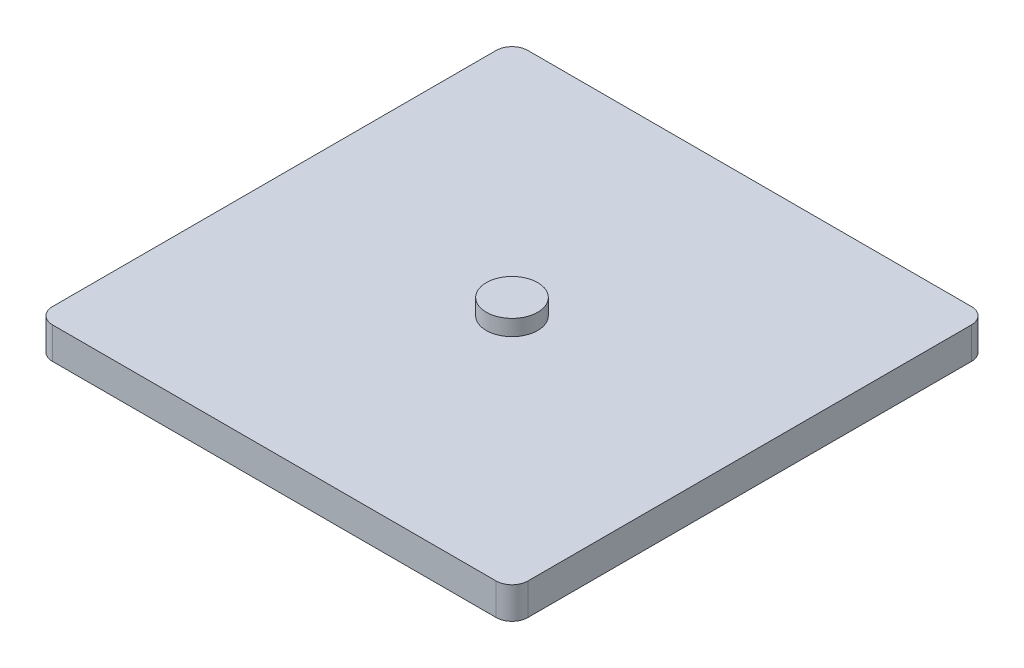
ISO-10303-21;
HEADER;
FILE_DESCRIPTION(('STEP AP214'),'2;1');
FILE_NAME('part.step','',(''),(''),'','','');
FILE_SCHEMA(('AUTOMOTIVE_DESIGN { 1 0 10303 214 1 1 1 1 }'));
ENDSEC;
DATA;
#1=APPLICATION_CONTEXT('core data for automotive mechanical design processes');
#2=APPLICATION_PROTOCOL_DEFINITION('international standard','automotive_design',2000,#1);
#3=PRODUCT_CONTEXT('',#1,'mechanical');
#4=PRODUCT('Part','Part','',(#3));
#5=PRODUCT_RELATED_PRODUCT_CATEGORY('part','',(#4));
#6=PRODUCT_DEFINITION_FORMATION('','',#4);
#7=PRODUCT_DEFINITION_CONTEXT('part definition',#1,'design');
#8=PRODUCT_DEFINITION('design','',#6,#7);
#9=PRODUCT_DEFINITION_SHAPE('','',#8);
#10=(LENGTH_UNIT() NAMED_UNIT(*) SI_UNIT(.MILLI.,.METRE.));
#11=(NAMED_UNIT(*) PLANE_ANGLE_UNIT() SI_UNIT($,.RADIAN.));
#12=(NAMED_UNIT(*) SI_UNIT($,.STERADIAN.) SOLID_ANGLE_UNIT());
#13=UNCERTAINTY_MEASURE_WITH_UNIT(LENGTH_MEASURE(1.E-05),#10,'distance_accuracy_value','');
#14=(GEOMETRIC_REPRESENTATION_CONTEXT(3) GLOBAL_UNCERTAINTY_ASSIGNED_CONTEXT((#13)) GLOBAL_UNIT_ASSIGNED_CONTEXT((#10,
#11,#12)) REPRESENTATION_CONTEXT('',''));
#15=CARTESIAN_POINT('',(0.,0.,0.));
#16=DIRECTION('',(0.,0.,1.));
#17=DIRECTION('',(1.,0.,0.));
#18=AXIS2_PLACEMENT_3D('',#15,#16,#17);
#19=CARTESIAN_POINT('',(150.,20.,-150.));
#20=DIRECTION('',(-1.,0.,0.));
#21=DIRECTION('',(0.,0.,1.));
#22=AXIS2_PLACEMENT_3D('',#19,#20,#21);
#23=PLANE('',#22);
#24=DIRECTION('',(0.,0.,-1.));
#25=VECTOR('',#24,1.);
#26=CARTESIAN_POINT('',(150.,0.,-150.));
#27=LINE('',#26,#25);
#28=CARTESIAN_POINT('',(150.,0.,140.));
#29=VERTEX_POINT('',#28);
#30=CARTESIAN_POINT('',(150.,0.,-140.));
#31=VERTEX_POINT('',#30);
#32=EDGE_CURVE('E128',#29,#31,#27,.T.);
#33=ORIENTED_EDGE('',*,*,#32,.T.);
#34=DIRECTION('',(0.,-1.,0.));
#35=VECTOR('',#34,1.);
#36=CARTESIAN_POINT('',(150.,20.,-140.));
#37=LINE('',#36,#35);
#38=CARTESIAN_POINT('',(150.,20.,-140.));
#39=VERTEX_POINT('',#38);
#40=EDGE_CURVE('E151',#31,#39,#37,.F.);
#41=ORIENTED_EDGE('',*,*,#40,.T.);
#42=DIRECTION('',(0.,0.,-1.));
#43=VECTOR('',#42,1.);
#44=CARTESIAN_POINT('',(150.,20.,-150.));
#45=LINE('',#44,#43);
#46=CARTESIAN_POINT('',(150.,20.,140.));
#47=VERTEX_POINT('',#46);
#48=EDGE_CURVE('E126',#47,#39,#45,.T.);
#49=ORIENTED_EDGE('',*,*,#48,.F.);
#50=DIRECTION('',(0.,-1.,0.));
#51=VECTOR('',#50,1.);
#52=CARTESIAN_POINT('',(150.,20.,140.));
#53=LINE('',#52,#51);
#54=EDGE_CURVE('E148',#47,#29,#53,.T.);
#55=ORIENTED_EDGE('',*,*,#54,.T.);
#56=EDGE_LOOP('',(#33,#41,#49,#55));
#57=FACE_BOUND('',#56,.T.);
#58=ADVANCED_FACE('F33',(#57),#23,.F.);
#59=CARTESIAN_POINT('',(-150.,20.,-150.));
#60=DIRECTION('',(0.,0.,1.));
#61=DIRECTION('',(1.,0.,0.));
#62=AXIS2_PLACEMENT_3D('',#59,#60,#61);
#63=PLANE('',#62);
#64=DIRECTION('',(-1.,0.,0.));
#65=VECTOR('',#64,1.);
#66=CARTESIAN_POINT('',(-150.,0.,-150.));
#67=LINE('',#66,#65);
#68=CARTESIAN_POINT('',(140.,0.,-150.));
#69=VERTEX_POINT('',#68);
#70=CARTESIAN_POINT('',(-140.,0.,-150.));
#71=VERTEX_POINT('',#70);
#72=EDGE_CURVE('E124',#69,#71,#67,.T.);
#73=ORIENTED_EDGE('',*,*,#72,.T.);
#74=DIRECTION('',(0.,-1.,0.));
#75=VECTOR('',#74,1.);
#76=CARTESIAN_POINT('',(-140.,20.,-150.));
#77=LINE('',#76,#75);
#78=CARTESIAN_POINT('',(-140.,20.,-150.));
#79=VERTEX_POINT('',#78);
#80=EDGE_CURVE('E103',#71,#79,#77,.F.);
#81=ORIENTED_EDGE('',*,*,#80,.T.);
#82=DIRECTION('',(-1.,0.,0.));
#83=VECTOR('',#82,1.);
#84=CARTESIAN_POINT('',(-150.,20.,-150.));
#85=LINE('',#84,#83);
#86=CARTESIAN_POINT('',(140.,20.,-150.));
#87=VERTEX_POINT('',#86);
#88=EDGE_CURVE('E167',#87,#79,#85,.T.);
#89=ORIENTED_EDGE('',*,*,#88,.F.);
#90=DIRECTION('',(0.,-1.,0.));
#91=VECTOR('',#90,1.);
#92=CARTESIAN_POINT('',(140.,20.,-150.));
#93=LINE('',#92,#91);
#94=EDGE_CURVE('E108',#87,#69,#93,.T.);
#95=ORIENTED_EDGE('',*,*,#94,.T.);
#96=EDGE_LOOP('',(#73,#81,#89,#95));
#97=FACE_BOUND('',#96,.T.);
#98=ADVANCED_FACE('F191',(#97),#63,.F.);
#99=CARTESIAN_POINT('',(-150.,20.,-150.));
#100=DIRECTION('',(1.,0.,0.));
#101=DIRECTION('',(0.,0.,-1.));
#102=AXIS2_PLACEMENT_3D('',#99,#100,#101);
#103=PLANE('',#102);
#104=DIRECTION('',(0.,0.,1.));
#105=VECTOR('',#104,1.);
#106=CARTESIAN_POINT('',(-150.,20.,-150.));
#107=LINE('',#106,#105);
#108=CARTESIAN_POINT('',(-150.,20.,-140.));
#109=VERTEX_POINT('',#108);
#110=CARTESIAN_POINT('',(-150.,20.,140.));
#111=VERTEX_POINT('',#110);
#112=EDGE_CURVE('E117',#109,#111,#107,.T.);
#113=ORIENTED_EDGE('',*,*,#112,.F.);
#114=DIRECTION('',(0.,-1.,0.));
#115=VECTOR('',#114,1.);
#116=CARTESIAN_POINT('',(-150.,20.,-140.));
#117=LINE('',#116,#115);
#118=CARTESIAN_POINT('',(-150.,0.,-140.));
#119=VERTEX_POINT('',#118);
#120=EDGE_CURVE('E102',#109,#119,#117,.T.);
#121=ORIENTED_EDGE('',*,*,#120,.T.);
#122=DIRECTION('',(0.,0.,1.));
#123=VECTOR('',#122,1.);
#124=CARTESIAN_POINT('',(-150.,0.,-150.));
#125=LINE('',#124,#123);
#126=CARTESIAN_POINT('',(-150.,0.,140.));
#127=VERTEX_POINT('',#126);
#128=EDGE_CURVE('E115',#119,#127,#125,.T.);
#129=ORIENTED_EDGE('',*,*,#128,.T.);
#130=DIRECTION('',(0.,-1.,0.));
#131=VECTOR('',#130,1.);
#132=CARTESIAN_POINT('',(-150.,20.,140.));
#133=LINE('',#132,#131);
#134=EDGE_CURVE('E119',#127,#111,#133,.F.);
#135=ORIENTED_EDGE('',*,*,#134,.T.);
#136=EDGE_LOOP('',(#113,#121,#129,#135));
#137=FACE_BOUND('',#136,.T.);
#138=ADVANCED_FACE('F114',(#137),#103,.F.);
#139=CARTESIAN_POINT('',(-150.,20.,150.));
#140=DIRECTION('',(0.,0.,-1.));
#141=DIRECTION('',(-1.,0.,0.));
#142=AXIS2_PLACEMENT_3D('',#139,#140,#141);
#143=PLANE('',#142);
#144=DIRECTION('',(1.,0.,0.));
#145=VECTOR('',#144,1.);
#146=CARTESIAN_POINT('',(-150.,0.,150.));
#147=LINE('',#146,#145);
#148=CARTESIAN_POINT('',(-140.,0.,150.));
#149=VERTEX_POINT('',#148);
#150=CARTESIAN_POINT('',(140.,0.,150.));
#151=VERTEX_POINT('',#150);
#152=EDGE_CURVE('E123',#149,#151,#147,.T.);
#153=ORIENTED_EDGE('',*,*,#152,.T.);
#154=DIRECTION('',(0.,-1.,0.));
#155=VECTOR('',#154,1.);
#156=CARTESIAN_POINT('',(140.,20.,150.));
#157=LINE('',#156,#155);
#158=CARTESIAN_POINT('',(140.,20.,150.));
#159=VERTEX_POINT('',#158);
#160=EDGE_CURVE('E11',#151,#159,#157,.F.);
#161=ORIENTED_EDGE('',*,*,#160,.T.);
#162=DIRECTION('',(1.,0.,0.));
#163=VECTOR('',#162,1.);
#164=CARTESIAN_POINT('',(-150.,20.,150.));
#165=LINE('',#164,#163);
#166=CARTESIAN_POINT('',(-140.,20.,150.));
#167=VERTEX_POINT('',#166);
#168=EDGE_CURVE('E132',#167,#159,#165,.T.);
#169=ORIENTED_EDGE('',*,*,#168,.F.);
#170=DIRECTION('',(0.,-1.,0.));
#171=VECTOR('',#170,1.);
#172=CARTESIAN_POINT('',(-140.,20.,150.));
#173=LINE('',#172,#171);
#174=EDGE_CURVE('E41',#167,#149,#173,.T.);
#175=ORIENTED_EDGE('',*,*,#174,.T.);
#176=EDGE_LOOP('',(#153,#161,#169,#175));
#177=FACE_BOUND('',#176,.T.);
#178=ADVANCED_FACE('F154',(#177),#143,.F.);
#179=CARTESIAN_POINT('',(0.,20.,0.));
#180=DIRECTION('',(0.,1.,0.));
#181=DIRECTION('',(0.,0.,1.));
#182=AXIS2_PLACEMENT_3D('',#179,#180,#181);
#183=PLANE('',#182);
#184=CARTESIAN_POINT('',(0.,20.,0.));
#185=DIRECTION('',(0.,1.,0.));
#186=DIRECTION('',(0.,0.,1.));
#187=AXIS2_PLACEMENT_3D('',#184,#185,#186);
#188=CIRCLE('',#187,16.2224776038044);
#189=CARTESIAN_POINT('',(0.,20.,16.2224776038044));
#190=VERTEX_POINT('',#189);
#191=EDGE_CURVE('E172',#190,#190,#188,.T.);
#192=ORIENTED_EDGE('',*,*,#191,.F.);
#193=EDGE_LOOP('',(#192));
#194=FACE_BOUND('',#193,.T.);
#195=ORIENTED_EDGE('',*,*,#88,.T.);
#196=CARTESIAN_POINT('',(-140.,20.,-140.));
#197=DIRECTION('',(0.,1.,0.));
#198=DIRECTION('',(0.,0.,1.));
#199=AXIS2_PLACEMENT_3D('',#196,#197,#198);
#200=CIRCLE('',#199,10.);
#201=EDGE_CURVE('E146',#79,#109,#200,.T.);
#202=ORIENTED_EDGE('',*,*,#201,.T.);
#203=ORIENTED_EDGE('',*,*,#112,.T.);
#204=CARTESIAN_POINT('',(-140.,20.,140.));
#205=DIRECTION('',(0.,1.,0.));
#206=DIRECTION('',(0.,0.,1.));
#207=AXIS2_PLACEMENT_3D('',#204,#205,#206);
#208=CIRCLE('',#207,10.);
#209=EDGE_CURVE('E53',#111,#167,#208,.T.);
#210=ORIENTED_EDGE('',*,*,#209,.T.);
#211=ORIENTED_EDGE('',*,*,#168,.T.);
#212=CARTESIAN_POINT('',(140.,20.,140.));
#213=DIRECTION('',(0.,1.,0.));
#214=DIRECTION('',(0.,0.,1.));
#215=AXIS2_PLACEMENT_3D('',#212,#213,#214);
#216=CIRCLE('',#215,10.);
#217=EDGE_CURVE('E142',#159,#47,#216,.T.);
#218=ORIENTED_EDGE('',*,*,#217,.T.);
#219=ORIENTED_EDGE('',*,*,#48,.T.);
#220=CARTESIAN_POINT('',(140.,20.,-140.));
#221=DIRECTION('',(0.,1.,0.));
#222=DIRECTION('',(0.,0.,1.));
#223=AXIS2_PLACEMENT_3D('',#220,#221,#222);
#224=CIRCLE('',#223,10.);
#225=EDGE_CURVE('E144',#39,#87,#224,.T.);
#226=ORIENTED_EDGE('',*,*,#225,.T.);
#227=EDGE_LOOP('',(#195,#202,#203,#210,#211,#218,#219,#226));
#228=FACE_BOUND('',#227,.T.);
#229=ADVANCED_FACE('F185',(#194,#228),#183,.T.);
#230=CARTESIAN_POINT('',(0.,0.,0.));
#231=DIRECTION('',(0.,1.,0.));
#232=DIRECTION('',(0.,0.,1.));
#233=AXIS2_PLACEMENT_3D('',#230,#231,#232);
#234=PLANE('',#233);
#235=ORIENTED_EDGE('',*,*,#128,.F.);
#236=CARTESIAN_POINT('',(-140.,0.,-140.));
#237=DIRECTION('',(0.,1.,0.));
#238=DIRECTION('',(0.,0.,1.));
#239=AXIS2_PLACEMENT_3D('',#236,#237,#238);
#240=CIRCLE('',#239,10.);
#241=EDGE_CURVE('E98',#119,#71,#240,.F.);
#242=ORIENTED_EDGE('',*,*,#241,.T.);
#243=ORIENTED_EDGE('',*,*,#72,.F.);
#244=CARTESIAN_POINT('',(140.,0.,-140.));
#245=DIRECTION('',(0.,1.,0.));
#246=DIRECTION('',(0.,0.,1.));
#247=AXIS2_PLACEMENT_3D('',#244,#245,#246);
#248=CIRCLE('',#247,10.);
#249=EDGE_CURVE('E109',#69,#31,#248,.F.);
#250=ORIENTED_EDGE('',*,*,#249,.T.);
#251=ORIENTED_EDGE('',*,*,#32,.F.);
#252=CARTESIAN_POINT('',(140.,0.,140.));
#253=DIRECTION('',(0.,1.,0.));
#254=DIRECTION('',(0.,0.,1.));
#255=AXIS2_PLACEMENT_3D('',#252,#253,#254);
#256=CIRCLE('',#255,10.);
#257=EDGE_CURVE('E135',#29,#151,#256,.F.);
#258=ORIENTED_EDGE('',*,*,#257,.T.);
#259=ORIENTED_EDGE('',*,*,#152,.F.);
#260=CARTESIAN_POINT('',(-140.,0.,140.));
#261=DIRECTION('',(0.,1.,0.));
#262=DIRECTION('',(0.,0.,1.));
#263=AXIS2_PLACEMENT_3D('',#260,#261,#262);
#264=CIRCLE('',#263,10.);
#265=EDGE_CURVE('E118',#149,#127,#264,.F.);
#266=ORIENTED_EDGE('',*,*,#265,.T.);
#267=EDGE_LOOP('',(#235,#242,#243,#250,#251,#258,#259,#266));
#268=FACE_BOUND('',#267,.T.);
#269=ADVANCED_FACE('F121',(#268),#234,.F.);
#270=CARTESIAN_POINT('',(-140.,20.,-140.));
#271=DIRECTION('',(0.,-1.,0.));
#272=DIRECTION('',(0.,0.,-1.));
#273=AXIS2_PLACEMENT_3D('',#270,#271,#272);
#274=CYLINDRICAL_SURFACE('',#273,10.);
#275=ORIENTED_EDGE('',*,*,#201,.F.);
#276=ORIENTED_EDGE('',*,*,#80,.F.);
#277=ORIENTED_EDGE('',*,*,#241,.F.);
#278=ORIENTED_EDGE('',*,*,#120,.F.);
#279=EDGE_LOOP('',(#275,#276,#277,#278));
#280=FACE_BOUND('',#279,.T.);
#281=ADVANCED_FACE('F101',(#280),#274,.T.);
#282=CARTESIAN_POINT('',(140.,20.,-140.));
#283=DIRECTION('',(0.,-1.,0.));
#284=DIRECTION('',(0.,0.,-1.));
#285=AXIS2_PLACEMENT_3D('',#282,#283,#284);
#286=CYLINDRICAL_SURFACE('',#285,10.);
#287=ORIENTED_EDGE('',*,*,#225,.F.);
#288=ORIENTED_EDGE('',*,*,#40,.F.);
#289=ORIENTED_EDGE('',*,*,#249,.F.);
#290=ORIENTED_EDGE('',*,*,#94,.F.);
#291=EDGE_LOOP('',(#287,#288,#289,#290));
#292=FACE_BOUND('',#291,.T.);
#293=ADVANCED_FACE('F193',(#292),#286,.T.);
#294=CARTESIAN_POINT('',(140.,20.,140.));
#295=DIRECTION('',(0.,-1.,0.));
#296=DIRECTION('',(0.,0.,-1.));
#297=AXIS2_PLACEMENT_3D('',#294,#295,#296);
#298=CYLINDRICAL_SURFACE('',#297,10.);
#299=ORIENTED_EDGE('',*,*,#217,.F.);
#300=ORIENTED_EDGE('',*,*,#160,.F.);
#301=ORIENTED_EDGE('',*,*,#257,.F.);
#302=ORIENTED_EDGE('',*,*,#54,.F.);
#303=EDGE_LOOP('',(#299,#300,#301,#302));
#304=FACE_BOUND('',#303,.T.);
#305=ADVANCED_FACE('F161',(#304),#298,.T.);
#306=CARTESIAN_POINT('',(-140.,20.,140.));
#307=DIRECTION('',(0.,-1.,0.));
#308=DIRECTION('',(0.,0.,-1.));
#309=AXIS2_PLACEMENT_3D('',#306,#307,#308);
#310=CYLINDRICAL_SURFACE('',#309,10.);
#311=ORIENTED_EDGE('',*,*,#209,.F.);
#312=ORIENTED_EDGE('',*,*,#134,.F.);
#313=ORIENTED_EDGE('',*,*,#265,.F.);
#314=ORIENTED_EDGE('',*,*,#174,.F.);
#315=EDGE_LOOP('',(#311,#312,#313,#314));
#316=FACE_BOUND('',#315,.T.);
#317=ADVANCED_FACE('F35',(#316),#310,.T.);
#318=CARTESIAN_POINT('',(0.,30.,0.));
#319=DIRECTION('',(0.,-1.,0.));
#320=DIRECTION('',(0.,0.,-1.));
#321=AXIS2_PLACEMENT_3D('',#318,#319,#320);
#322=CYLINDRICAL_SURFACE('',#321,16.2224776038044);
#323=CARTESIAN_POINT('',(0.,30.,0.));
#324=DIRECTION('',(0.,1.,0.));
#325=DIRECTION('',(0.,0.,1.));
#326=AXIS2_PLACEMENT_3D('',#323,#324,#325);
#327=CIRCLE('',#326,16.2224776038044);
#328=CARTESIAN_POINT('',(0.,30.,16.2224776038044));
#329=VERTEX_POINT('',#328);
#330=EDGE_CURVE('E176',#329,#329,#327,.T.);
#331=ORIENTED_EDGE('',*,*,#330,.F.);
#332=EDGE_LOOP('',(#331));
#333=FACE_BOUND('',#332,.T.);
#334=ORIENTED_EDGE('',*,*,#191,.T.);
#335=EDGE_LOOP('',(#334));
#336=FACE_BOUND('',#335,.T.);
#337=ADVANCED_FACE('F183',(#333,#336),#322,.T.);
#338=CARTESIAN_POINT('',(0.,30.,0.));
#339=DIRECTION('',(0.,1.,0.));
#340=DIRECTION('',(0.,0.,1.));
#341=AXIS2_PLACEMENT_3D('',#338,#339,#340);
#342=PLANE('',#341);
#343=ORIENTED_EDGE('',*,*,#330,.T.);
#344=EDGE_LOOP('',(#343));
#345=FACE_BOUND('',#344,.T.);
#346=ADVANCED_FACE('F216',(#345),#342,.T.);
#347=CLOSED_SHELL('',(#58,#98,#138,#178,#229,#269,#281,#293,#305,#317,#337,#346));
#348=MANIFOLD_SOLID_BREP('B2',#347);
#349=ADVANCED_BREP_SHAPE_REPRESENTATION('',(#18,#348),#14);
#350=SHAPE_DEFINITION_REPRESENTATION(#9,#349);
ENDSEC;
END-ISO-10303-21;
